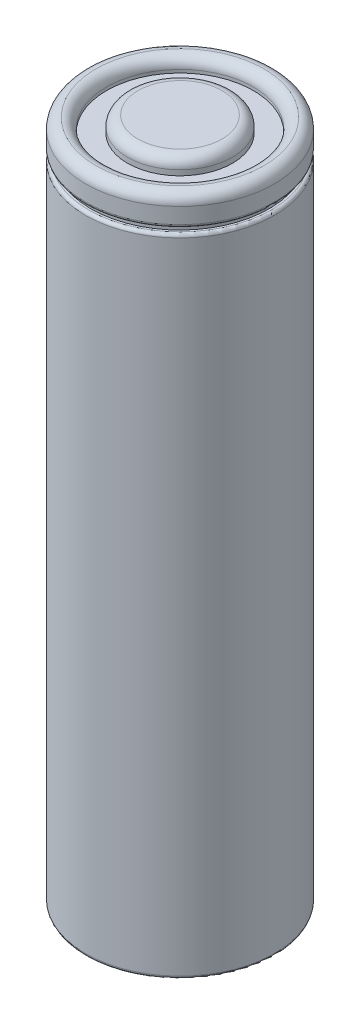
ISO-10303-21;
HEADER;
FILE_DESCRIPTION(('STEP AP214'),'2;1');
FILE_NAME('part.step','',(''),(''),'','','');
FILE_SCHEMA(('AUTOMOTIVE_DESIGN { 1 0 10303 214 1 1 1 1 }'));
ENDSEC;
DATA;
#1=APPLICATION_CONTEXT('core data for automotive mechanical design processes');
#2=APPLICATION_PROTOCOL_DEFINITION('international standard','automotive_design',2000,#1);
#3=PRODUCT_CONTEXT('',#1,'mechanical');
#4=PRODUCT('Part','Part','',(#3));
#5=PRODUCT_RELATED_PRODUCT_CATEGORY('part','',(#4));
#6=PRODUCT_DEFINITION_FORMATION('','',#4);
#7=PRODUCT_DEFINITION_CONTEXT('part definition',#1,'design');
#8=PRODUCT_DEFINITION('design','',#6,#7);
#9=PRODUCT_DEFINITION_SHAPE('','',#8);
#10=(LENGTH_UNIT() NAMED_UNIT(*) SI_UNIT(.MILLI.,.METRE.));
#11=(NAMED_UNIT(*) PLANE_ANGLE_UNIT() SI_UNIT($,.RADIAN.));
#12=(NAMED_UNIT(*) SI_UNIT($,.STERADIAN.) SOLID_ANGLE_UNIT());
#13=UNCERTAINTY_MEASURE_WITH_UNIT(LENGTH_MEASURE(1.E-05),#10,'distance_accuracy_value','');
#14=(GEOMETRIC_REPRESENTATION_CONTEXT(3) GLOBAL_UNCERTAINTY_ASSIGNED_CONTEXT((#13)) GLOBAL_UNIT_ASSIGNED_CONTEXT((#10,
#11,#12)) REPRESENTATION_CONTEXT('',''));
#15=CARTESIAN_POINT('',(0.,0.,0.));
#16=DIRECTION('',(0.,0.,1.));
#17=DIRECTION('',(1.,0.,0.));
#18=AXIS2_PLACEMENT_3D('',#15,#16,#17);
#19=CARTESIAN_POINT('',(0.,65.,0.));
#20=DIRECTION('',(0.,-1.,0.));
#21=DIRECTION('',(0.,0.,-1.));
#22=AXIS2_PLACEMENT_3D('',#19,#20,#21);
#23=CYLINDRICAL_SURFACE('',#22,9.00000000000001);
#24=CARTESIAN_POINT('',(0.,62.3,0.));
#25=DIRECTION('',(0.,-1.,0.));
#26=DIRECTION('',(0.,0.,-1.));
#27=AXIS2_PLACEMENT_3D('',#24,#25,#26);
#28=CIRCLE('',#27,9.00000000000001);
#29=CARTESIAN_POINT('',(0.,62.3,-9.00000000000001));
#30=VERTEX_POINT('',#29);
#31=EDGE_CURVE('E50',#30,#30,#28,.F.);
#32=ORIENTED_EDGE('',*,*,#31,.T.);
#33=EDGE_LOOP('',(#32));
#34=FACE_BOUND('',#33,.T.);
#35=CARTESIAN_POINT('',(0.,63.8,0.));
#36=DIRECTION('',(0.,1.,0.));
#37=DIRECTION('',(0.,0.,1.));
#38=AXIS2_PLACEMENT_3D('',#35,#36,#37);
#39=CIRCLE('',#38,9.00000000000001);
#40=CARTESIAN_POINT('',(0.,63.8,9.00000000000001));
#41=VERTEX_POINT('',#40);
#42=EDGE_CURVE('E69',#41,#41,#39,.F.);
#43=ORIENTED_EDGE('',*,*,#42,.T.);
#44=EDGE_LOOP('',(#43));
#45=FACE_BOUND('',#44,.T.);
#46=ADVANCED_FACE('F43',(#34,#45),#23,.T.);
#47=CARTESIAN_POINT('',(0.,65.,0.));
#48=DIRECTION('',(0.,1.,0.));
#49=DIRECTION('',(0.,0.,1.));
#50=AXIS2_PLACEMENT_3D('',#47,#48,#49);
#51=CYLINDRICAL_SURFACE('',#50,5.00000000000001);
#52=CARTESIAN_POINT('',(0.,64.,0.));
#53=DIRECTION('',(0.,1.,0.));
#54=DIRECTION('',(0.,0.,1.));
#55=AXIS2_PLACEMENT_3D('',#52,#53,#54);
#56=CIRCLE('',#55,5.00000000000001);
#57=CARTESIAN_POINT('',(0.,64.,5.00000000000001));
#58=VERTEX_POINT('',#57);
#59=EDGE_CURVE('E79',#58,#58,#56,.F.);
#60=ORIENTED_EDGE('',*,*,#59,.T.);
#61=EDGE_LOOP('',(#60));
#62=FACE_BOUND('',#61,.T.);
#63=CARTESIAN_POINT('',(0.,63.5,0.));
#64=DIRECTION('',(0.,1.,0.));
#65=DIRECTION('',(0.,0.,1.));
#66=AXIS2_PLACEMENT_3D('',#63,#64,#65);
#67=CIRCLE('',#66,5.00000000000001);
#68=CARTESIAN_POINT('',(0.,63.5,5.00000000000001));
#69=VERTEX_POINT('',#68);
#70=EDGE_CURVE('E85',#69,#69,#67,.T.);
#71=ORIENTED_EDGE('',*,*,#70,.T.);
#72=EDGE_LOOP('',(#71));
#73=FACE_BOUND('',#72,.T.);
#74=ADVANCED_FACE('F116',(#62,#73),#51,.T.);
#75=CARTESIAN_POINT('',(5.00000000000001,63.5,0.));
#76=DIRECTION('',(0.,1.,0.));
#77=DIRECTION('',(0.,0.,1.));
#78=AXIS2_PLACEMENT_3D('',#75,#76,#77);
#79=PLANE('',#78);
#80=CARTESIAN_POINT('',(0.,63.5,0.));
#81=DIRECTION('',(0.,1.,0.));
#82=DIRECTION('',(0.,0.,1.));
#83=AXIS2_PLACEMENT_3D('',#80,#81,#82);
#84=CIRCLE('',#83,7.00000000000001);
#85=CARTESIAN_POINT('',(0.,63.5,7.00000000000001));
#86=VERTEX_POINT('',#85);
#87=EDGE_CURVE('E88',#86,#86,#84,.T.);
#88=ORIENTED_EDGE('',*,*,#87,.T.);
#89=EDGE_LOOP('',(#88));
#90=FACE_BOUND('',#89,.T.);
#91=ORIENTED_EDGE('',*,*,#70,.F.);
#92=EDGE_LOOP('',(#91));
#93=FACE_BOUND('',#92,.T.);
#94=ADVANCED_FACE('F122',(#90,#93),#79,.T.);
#95=CARTESIAN_POINT('',(0.,65.,0.));
#96=DIRECTION('',(0.,1.,0.));
#97=DIRECTION('',(0.,0.,1.));
#98=AXIS2_PLACEMENT_3D('',#95,#96,#97);
#99=CYLINDRICAL_SURFACE('',#98,7.00000000000001);
#100=CARTESIAN_POINT('',(0.,63.8,0.));
#101=DIRECTION('',(0.,1.,0.));
#102=DIRECTION('',(0.,0.,1.));
#103=AXIS2_PLACEMENT_3D('',#100,#101,#102);
#104=CIRCLE('',#103,7.00000000000001);
#105=CARTESIAN_POINT('',(0.,63.8,7.00000000000001));
#106=VERTEX_POINT('',#105);
#107=EDGE_CURVE('E76',#106,#106,#104,.T.);
#108=ORIENTED_EDGE('',*,*,#107,.T.);
#109=EDGE_LOOP('',(#108));
#110=FACE_BOUND('',#109,.T.);
#111=ORIENTED_EDGE('',*,*,#87,.F.);
#112=EDGE_LOOP('',(#111));
#113=FACE_BOUND('',#112,.T.);
#114=ADVANCED_FACE('F111',(#110,#113),#99,.F.);
#115=CARTESIAN_POINT('',(0.,65.,0.));
#116=DIRECTION('',(0.,1.,0.));
#117=DIRECTION('',(0.,0.,1.));
#118=AXIS2_PLACEMENT_3D('',#115,#116,#117);
#119=PLANE('',#118);
#120=CARTESIAN_POINT('',(0.,65.,0.));
#121=DIRECTION('',(0.,1.,0.));
#122=DIRECTION('',(0.,0.,1.));
#123=AXIS2_PLACEMENT_3D('',#120,#121,#122);
#124=CIRCLE('',#123,4.00000000000001);
#125=CARTESIAN_POINT('',(0.,65.,4.00000000000001));
#126=VERTEX_POINT('',#125);
#127=EDGE_CURVE('E82',#126,#126,#124,.T.);
#128=ORIENTED_EDGE('',*,*,#127,.T.);
#129=EDGE_LOOP('',(#128));
#130=FACE_BOUND('',#129,.T.);
#131=ADVANCED_FACE('F102',(#130),#119,.T.);
#132=CARTESIAN_POINT('',(0.,65.,0.));
#133=DIRECTION('',(0.,1.,0.));
#134=DIRECTION('',(0.,0.,1.));
#135=AXIS2_PLACEMENT_3D('',#132,#133,#134);
#136=CYLINDRICAL_SURFACE('',#135,8.50000000000001);
#137=CARTESIAN_POINT('',(0.,61.5,0.));
#138=DIRECTION('',(0.,1.,0.));
#139=DIRECTION('',(0.,0.,1.));
#140=AXIS2_PLACEMENT_3D('',#137,#138,#139);
#141=CIRCLE('',#140,8.50000000000001);
#142=CARTESIAN_POINT('',(0.,61.5,8.50000000000001));
#143=VERTEX_POINT('',#142);
#144=EDGE_CURVE('E91',#143,#143,#141,.T.);
#145=ORIENTED_EDGE('',*,*,#144,.T.);
#146=EDGE_LOOP('',(#145));
#147=FACE_BOUND('',#146,.T.);
#148=CARTESIAN_POINT('',(0.,62.,0.));
#149=DIRECTION('',(0.,1.,0.));
#150=DIRECTION('',(0.,0.,1.));
#151=AXIS2_PLACEMENT_3D('',#148,#149,#150);
#152=CIRCLE('',#151,8.50000000000001);
#153=CARTESIAN_POINT('',(0.,62.,8.50000000000001));
#154=VERTEX_POINT('',#153);
#155=EDGE_CURVE('E73',#154,#154,#152,.T.);
#156=ORIENTED_EDGE('',*,*,#155,.F.);
#157=EDGE_LOOP('',(#156));
#158=FACE_BOUND('',#157,.T.);
#159=ADVANCED_FACE('F99',(#147,#158),#136,.T.);
#160=CARTESIAN_POINT('',(8.50000000000001,61.5,0.));
#161=DIRECTION('',(0.,1.,0.));
#162=DIRECTION('',(0.,0.,1.));
#163=AXIS2_PLACEMENT_3D('',#160,#161,#162);
#164=PLANE('',#163);
#165=CARTESIAN_POINT('',(0.,61.5,0.));
#166=DIRECTION('',(0.,1.,0.));
#167=DIRECTION('',(0.,0.,1.));
#168=AXIS2_PLACEMENT_3D('',#165,#166,#167);
#169=CIRCLE('',#168,8.70000000000001);
#170=CARTESIAN_POINT('',(0.,61.5,8.70000000000001));
#171=VERTEX_POINT('',#170);
#172=EDGE_CURVE('E54',#171,#171,#169,.T.);
#173=ORIENTED_EDGE('',*,*,#172,.T.);
#174=EDGE_LOOP('',(#173));
#175=FACE_BOUND('',#174,.T.);
#176=ORIENTED_EDGE('',*,*,#144,.F.);
#177=EDGE_LOOP('',(#176));
#178=FACE_BOUND('',#177,.T.);
#179=ADVANCED_FACE('F101',(#175,#178),#164,.T.);
#180=CARTESIAN_POINT('',(8.50000000000001,62.,0.));
#181=DIRECTION('',(0.,-1.,0.));
#182=DIRECTION('',(0.,0.,-1.));
#183=AXIS2_PLACEMENT_3D('',#180,#181,#182);
#184=PLANE('',#183);
#185=CARTESIAN_POINT('',(0.,62.,0.));
#186=DIRECTION('',(0.,-1.,0.));
#187=DIRECTION('',(0.,0.,-1.));
#188=AXIS2_PLACEMENT_3D('',#185,#186,#187);
#189=CIRCLE('',#188,8.70000000000001);
#190=CARTESIAN_POINT('',(0.,62.,-8.70000000000001));
#191=VERTEX_POINT('',#190);
#192=EDGE_CURVE('E12',#191,#191,#189,.T.);
#193=ORIENTED_EDGE('',*,*,#192,.T.);
#194=EDGE_LOOP('',(#193));
#195=FACE_BOUND('',#194,.T.);
#196=ORIENTED_EDGE('',*,*,#155,.T.);
#197=EDGE_LOOP('',(#196));
#198=FACE_BOUND('',#197,.T.);
#199=ADVANCED_FACE('F97',(#195,#198),#184,.T.);
#200=CARTESIAN_POINT('',(0.,0.,0.));
#201=DIRECTION('',(0.,1.,0.));
#202=DIRECTION('',(0.,0.,1.));
#203=AXIS2_PLACEMENT_3D('',#200,#201,#202);
#204=PLANE('',#203);
#205=CARTESIAN_POINT('',(0.,0.,0.));
#206=DIRECTION('',(0.,1.,0.));
#207=DIRECTION('',(0.,0.,1.));
#208=AXIS2_PLACEMENT_3D('',#205,#206,#207);
#209=CIRCLE('',#208,8.70000000000001);
#210=CARTESIAN_POINT('',(0.,0.,8.70000000000001));
#211=VERTEX_POINT('',#210);
#212=EDGE_CURVE('E58',#211,#211,#209,.F.);
#213=ORIENTED_EDGE('',*,*,#212,.T.);
#214=EDGE_LOOP('',(#213));
#215=FACE_BOUND('',#214,.T.);
#216=ADVANCED_FACE('F130',(#215),#204,.F.);
#217=CARTESIAN_POINT('',(0.,0.299999999999995,0.));
#218=DIRECTION('',(0.,1.,0.));
#219=DIRECTION('',(0.,0.,1.));
#220=AXIS2_PLACEMENT_3D('',#217,#218,#219);
#221=CIRCLE('',#220,9.00000000000001);
#222=CARTESIAN_POINT('',(0.,0.299999999999995,9.00000000000001));
#223=VERTEX_POINT('',#222);
#224=EDGE_CURVE('E63',#223,#223,#221,.T.);
#225=ORIENTED_EDGE('',*,*,#224,.T.);
#226=EDGE_LOOP('',(#225));
#227=FACE_BOUND('',#226,.T.);
#228=CARTESIAN_POINT('',(0.,61.2,0.));
#229=DIRECTION('',(0.,1.,0.));
#230=DIRECTION('',(0.,0.,1.));
#231=AXIS2_PLACEMENT_3D('',#228,#229,#230);
#232=CIRCLE('',#231,9.00000000000001);
#233=CARTESIAN_POINT('',(0.,61.2,9.00000000000001));
#234=VERTEX_POINT('',#233);
#235=EDGE_CURVE('E66',#234,#234,#232,.F.);
#236=ORIENTED_EDGE('',*,*,#235,.T.);
#237=EDGE_LOOP('',(#236));
#238=FACE_BOUND('',#237,.T.);
#239=ADVANCED_FACE('F118',(#227,#238),#23,.T.);
#240=CARTESIAN_POINT('',(0.,64.,0.));
#241=DIRECTION('',(0.,1.,0.));
#242=DIRECTION('',(0.,0.,1.));
#243=AXIS2_PLACEMENT_3D('',#240,#241,#242);
#244=TOROIDAL_SURFACE('',#243,4.00000000000001,1.);
#245=ORIENTED_EDGE('',*,*,#59,.F.);
#246=EDGE_LOOP('',(#245));
#247=FACE_BOUND('',#246,.T.);
#248=ORIENTED_EDGE('',*,*,#127,.F.);
#249=EDGE_LOOP('',(#248));
#250=FACE_BOUND('',#249,.T.);
#251=ADVANCED_FACE('F129',(#247,#250),#244,.T.);
#252=CARTESIAN_POINT('',(0.,63.8,0.));
#253=DIRECTION('',(0.,1.,0.));
#254=DIRECTION('',(0.,0.,1.));
#255=AXIS2_PLACEMENT_3D('',#252,#253,#254);
#256=TOROIDAL_SURFACE('',#255,8.00000000000001,1.);
#257=ORIENTED_EDGE('',*,*,#42,.F.);
#258=EDGE_LOOP('',(#257));
#259=FACE_BOUND('',#258,.T.);
#260=CARTESIAN_POINT('',(0.,64.8,0.));
#261=DIRECTION('',(0.,1.,0.));
#262=DIRECTION('',(0.,0.,1.));
#263=AXIS2_PLACEMENT_3D('',#260,#261,#262);
#264=CIRCLE('',#263,8.00000000000001);
#265=CARTESIAN_POINT('',(0.,64.8,8.00000000000001));
#266=VERTEX_POINT('',#265);
#267=EDGE_CURVE('E70',#266,#266,#264,.T.);
#268=ORIENTED_EDGE('',*,*,#267,.F.);
#269=EDGE_LOOP('',(#268));
#270=FACE_BOUND('',#269,.T.);
#271=ADVANCED_FACE('F136',(#259,#270),#256,.T.);
#272=CARTESIAN_POINT('',(0.,63.8,0.));
#273=DIRECTION('',(0.,1.,0.));
#274=DIRECTION('',(0.,0.,1.));
#275=AXIS2_PLACEMENT_3D('',#272,#273,#274);
#276=TOROIDAL_SURFACE('',#275,8.00000000000001,1.);
#277=ORIENTED_EDGE('',*,*,#267,.T.);
#278=EDGE_LOOP('',(#277));
#279=FACE_BOUND('',#278,.T.);
#280=ORIENTED_EDGE('',*,*,#107,.F.);
#281=EDGE_LOOP('',(#280));
#282=FACE_BOUND('',#281,.T.);
#283=ADVANCED_FACE('F155',(#279,#282),#276,.T.);
#284=CARTESIAN_POINT('',(0.,0.299999999999995,0.));
#285=DIRECTION('',(0.,1.,0.));
#286=DIRECTION('',(0.,0.,1.));
#287=AXIS2_PLACEMENT_3D('',#284,#285,#286);
#288=TOROIDAL_SURFACE('',#287,8.70000000000001,0.3);
#289=ORIENTED_EDGE('',*,*,#212,.F.);
#290=EDGE_LOOP('',(#289));
#291=FACE_BOUND('',#290,.T.);
#292=ORIENTED_EDGE('',*,*,#224,.F.);
#293=EDGE_LOOP('',(#292));
#294=FACE_BOUND('',#293,.T.);
#295=ADVANCED_FACE('F146',(#291,#294),#288,.T.);
#296=CARTESIAN_POINT('',(0.,61.2,0.));
#297=DIRECTION('',(0.,1.,0.));
#298=DIRECTION('',(0.,0.,1.));
#299=AXIS2_PLACEMENT_3D('',#296,#297,#298);
#300=TOROIDAL_SURFACE('',#299,8.70000000000001,0.3);
#301=ORIENTED_EDGE('',*,*,#235,.F.);
#302=EDGE_LOOP('',(#301));
#303=FACE_BOUND('',#302,.T.);
#304=ORIENTED_EDGE('',*,*,#172,.F.);
#305=EDGE_LOOP('',(#304));
#306=FACE_BOUND('',#305,.T.);
#307=ADVANCED_FACE('F143',(#303,#306),#300,.T.);
#308=CARTESIAN_POINT('',(0.,62.3,0.));
#309=DIRECTION('',(0.,-1.,0.));
#310=DIRECTION('',(0.,0.,-1.));
#311=AXIS2_PLACEMENT_3D('',#308,#309,#310);
#312=TOROIDAL_SURFACE('',#311,8.70000000000001,0.3);
#313=ORIENTED_EDGE('',*,*,#192,.F.);
#314=EDGE_LOOP('',(#313));
#315=FACE_BOUND('',#314,.T.);
#316=ORIENTED_EDGE('',*,*,#31,.F.);
#317=EDGE_LOOP('',(#316));
#318=FACE_BOUND('',#317,.T.);
#319=ADVANCED_FACE('F45',(#315,#318),#312,.T.);
#320=CLOSED_SHELL('',(#46,#74,#94,#114,#131,#159,#179,#199,#216,#239,#251,#271,#283,#295,#307,#319));
#321=MANIFOLD_SOLID_BREP('B2',#320);
#322=ADVANCED_BREP_SHAPE_REPRESENTATION('',(#18,#321),#14);
#323=SHAPE_DEFINITION_REPRESENTATION(#9,#322);
ENDSEC;
END-ISO-10303-21;
